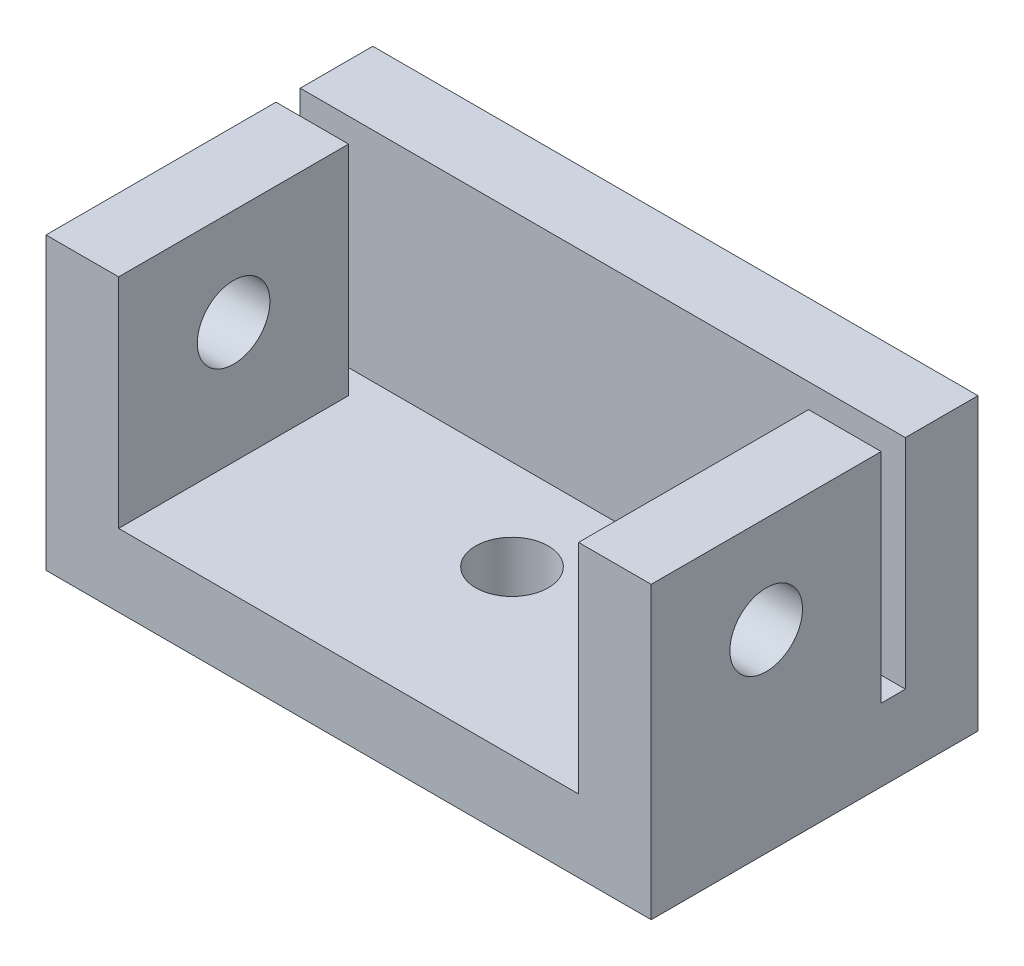
ISO-10303-21;
HEADER;
FILE_DESCRIPTION(('STEP AP214'),'2;1');
FILE_NAME('part.step','',(''),(''),'','','');
FILE_SCHEMA(('AUTOMOTIVE_DESIGN { 1 0 10303 214 1 1 1 1 }'));
ENDSEC;
DATA;
#1=APPLICATION_CONTEXT('core data for automotive mechanical design processes');
#2=APPLICATION_PROTOCOL_DEFINITION('international standard','automotive_design',2000,#1);
#3=PRODUCT_CONTEXT('',#1,'mechanical');
#4=PRODUCT('Part','Part','',(#3));
#5=PRODUCT_RELATED_PRODUCT_CATEGORY('part','',(#4));
#6=PRODUCT_DEFINITION_FORMATION('','',#4);
#7=PRODUCT_DEFINITION_CONTEXT('part definition',#1,'design');
#8=PRODUCT_DEFINITION('design','',#6,#7);
#9=PRODUCT_DEFINITION_SHAPE('','',#8);
#10=(LENGTH_UNIT() NAMED_UNIT(*) SI_UNIT(.MILLI.,.METRE.));
#11=(NAMED_UNIT(*) PLANE_ANGLE_UNIT() SI_UNIT($,.RADIAN.));
#12=(NAMED_UNIT(*) SI_UNIT($,.STERADIAN.) SOLID_ANGLE_UNIT());
#13=UNCERTAINTY_MEASURE_WITH_UNIT(LENGTH_MEASURE(1.E-05),#10,'distance_accuracy_value','');
#14=(GEOMETRIC_REPRESENTATION_CONTEXT(3) GLOBAL_UNCERTAINTY_ASSIGNED_CONTEXT((#13)) GLOBAL_UNIT_ASSIGNED_CONTEXT((#10,
#11,#12)) REPRESENTATION_CONTEXT('',''));
#15=CARTESIAN_POINT('',(0.,0.,0.));
#16=DIRECTION('',(0.,0.,1.));
#17=DIRECTION('',(1.,0.,0.));
#18=AXIS2_PLACEMENT_3D('',#15,#16,#17);
#19=CARTESIAN_POINT('',(694.894917120642,108.315701745268,-247.056360518351));
#20=DIRECTION('',(0.,0.,-1.));
#21=DIRECTION('',(-1.,0.,0.));
#22=AXIS2_PLACEMENT_3D('',#19,#20,#21);
#23=PLANE('',#22);
#24=DIRECTION('',(1.,0.,0.));
#25=VECTOR('',#24,1.);
#26=CARTESIAN_POINT('',(733.95134093076,90.3157017452683,-247.056360518351));
#27=LINE('',#26,#25);
#28=CARTESIAN_POINT('',(694.894917120642,90.3157017452683,-247.056360518351));
#29=VERTEX_POINT('',#28);
#30=CARTESIAN_POINT('',(688.894917120642,90.3157017452683,-247.056360518351));
#31=VERTEX_POINT('',#30);
#32=EDGE_CURVE('E195',#29,#31,#27,.F.);
#33=ORIENTED_EDGE('',*,*,#32,.T.);
#34=DIRECTION('',(0.,1.,0.));
#35=VECTOR('',#34,1.);
#36=CARTESIAN_POINT('',(688.894917120642,108.315701745268,-247.056360518351));
#37=LINE('',#36,#35);
#38=CARTESIAN_POINT('',(688.894917120642,108.315701745268,-247.056360518351));
#39=VERTEX_POINT('',#38);
#40=EDGE_CURVE('E128',#39,#31,#37,.F.);
#41=ORIENTED_EDGE('',*,*,#40,.F.);
#42=DIRECTION('',(1.,0.,0.));
#43=VECTOR('',#42,1.);
#44=CARTESIAN_POINT('',(556.61416335875,108.315701745268,-247.056360518351));
#45=LINE('',#44,#43);
#46=CARTESIAN_POINT('',(694.894917120642,108.315701745268,-247.056360518351));
#47=VERTEX_POINT('',#46);
#48=EDGE_CURVE('E123',#47,#39,#45,.F.);
#49=ORIENTED_EDGE('',*,*,#48,.F.);
#50=DIRECTION('',(0.,1.,0.));
#51=VECTOR('',#50,1.);
#52=CARTESIAN_POINT('',(694.894917120642,108.315701745268,-247.056360518351));
#53=LINE('',#52,#51);
#54=EDGE_CURVE('E108',#29,#47,#53,.T.);
#55=ORIENTED_EDGE('',*,*,#54,.F.);
#56=EDGE_LOOP('',(#33,#41,#49,#55));
#57=FACE_BOUND('',#56,.T.);
#58=ADVANCED_FACE('F17',(#57),#23,.T.);
#59=CARTESIAN_POINT('',(683.894893120642,100.315701745268,-237.556360518351));
#60=DIRECTION('',(1.,0.,0.));
#61=DIRECTION('',(0.,0.,-1.));
#62=AXIS2_PLACEMENT_3D('',#59,#60,#61);
#63=CYLINDRICAL_SURFACE('',#62,3.);
#64=CARTESIAN_POINT('',(694.894917120642,100.315701745268,-237.556360518351));
#65=DIRECTION('',(1.,0.,0.));
#66=DIRECTION('',(0.,0.,-1.));
#67=AXIS2_PLACEMENT_3D('',#64,#65,#66);
#68=CIRCLE('',#67,3.);
#69=CARTESIAN_POINT('',(694.894917120642,100.315701745268,-240.556360518351));
#70=VERTEX_POINT('',#69);
#71=EDGE_CURVE('E20',#70,#70,#68,.F.);
#72=ORIENTED_EDGE('',*,*,#71,.F.);
#73=EDGE_LOOP('',(#72));
#74=FACE_BOUND('',#73,.T.);
#75=CARTESIAN_POINT('',(688.894917120642,100.315701745268,-237.556360518351));
#76=DIRECTION('',(1.,0.,0.));
#77=DIRECTION('',(0.,0.,-1.));
#78=AXIS2_PLACEMENT_3D('',#75,#76,#77);
#79=CIRCLE('',#78,3.);
#80=CARTESIAN_POINT('',(688.894917120642,100.315701745268,-240.556360518351));
#81=VERTEX_POINT('',#80);
#82=EDGE_CURVE('E142',#81,#81,#79,.T.);
#83=ORIENTED_EDGE('',*,*,#82,.F.);
#84=EDGE_LOOP('',(#83));
#85=FACE_BOUND('',#84,.T.);
#86=ADVANCED_FACE('F379',(#74,#85),#63,.F.);
#87=CARTESIAN_POINT('',(694.894917120642,108.315701745268,-228.056360518351));
#88=DIRECTION('',(1.,0.,0.));
#89=DIRECTION('',(0.,0.,-1.));
#90=AXIS2_PLACEMENT_3D('',#87,#88,#89);
#91=PLANE('',#90);
#92=ORIENTED_EDGE('',*,*,#71,.T.);
#93=EDGE_LOOP('',(#92));
#94=FACE_BOUND('',#93,.T.);
#95=DIRECTION('',(0.,0.,-1.));
#96=VECTOR('',#95,1.);
#97=CARTESIAN_POINT('',(694.894917120642,90.3157017452683,-252.736733103206));
#98=LINE('',#97,#96);
#99=CARTESIAN_POINT('',(694.894917120642,90.3157017452683,-228.056360518351));
#100=VERTEX_POINT('',#99);
#101=EDGE_CURVE('E114',#100,#29,#98,.T.);
#102=ORIENTED_EDGE('',*,*,#101,.T.);
#103=ORIENTED_EDGE('',*,*,#54,.T.);
#104=DIRECTION('',(0.,0.,1.));
#105=VECTOR('',#104,1.);
#106=CARTESIAN_POINT('',(694.894917120642,108.315701745268,-58.6570709718798));
#107=LINE('',#106,#105);
#108=CARTESIAN_POINT('',(694.894917120642,108.315701745268,-228.056360518351));
#109=VERTEX_POINT('',#108);
#110=EDGE_CURVE('E112',#109,#47,#107,.F.);
#111=ORIENTED_EDGE('',*,*,#110,.F.);
#112=DIRECTION('',(0.,1.,0.));
#113=VECTOR('',#112,1.);
#114=CARTESIAN_POINT('',(694.894917120642,84.3157017452683,-228.056360518351));
#115=LINE('',#114,#113);
#116=EDGE_CURVE('E212',#100,#109,#115,.T.);
#117=ORIENTED_EDGE('',*,*,#116,.F.);
#118=EDGE_LOOP('',(#102,#103,#111,#117));
#119=FACE_BOUND('',#118,.T.);
#120=ADVANCED_FACE('F110',(#94,#119),#91,.T.);
#121=CARTESIAN_POINT('',(556.61416335875,108.315701745268,-58.6570709718798));
#122=DIRECTION('',(0.,1.,0.));
#123=DIRECTION('',(0.,0.,1.));
#124=AXIS2_PLACEMENT_3D('',#121,#122,#123);
#125=PLANE('',#124);
#126=DIRECTION('',(0.,0.,1.));
#127=VECTOR('',#126,1.);
#128=CARTESIAN_POINT('',(688.894917120642,108.315701745268,-247.056360518351));
#129=LINE('',#128,#127);
#130=CARTESIAN_POINT('',(688.894917120642,108.315701745268,-228.056360518351));
#131=VERTEX_POINT('',#130);
#132=EDGE_CURVE('E190',#131,#39,#129,.F.);
#133=ORIENTED_EDGE('',*,*,#132,.F.);
#134=DIRECTION('',(1.,0.,0.));
#135=VECTOR('',#134,1.);
#136=CARTESIAN_POINT('',(738.894917120642,108.315701745268,-228.056360518351));
#137=LINE('',#136,#135);
#138=EDGE_CURVE('E125',#109,#131,#137,.F.);
#139=ORIENTED_EDGE('',*,*,#138,.F.);
#140=ORIENTED_EDGE('',*,*,#110,.T.);
#141=ORIENTED_EDGE('',*,*,#48,.T.);
#142=EDGE_LOOP('',(#133,#139,#140,#141));
#143=FACE_BOUND('',#142,.T.);
#144=ADVANCED_FACE('F122',(#143),#125,.T.);
#145=CARTESIAN_POINT('',(732.894917120642,108.315701745268,-247.056360518351));
#146=DIRECTION('',(-1.,0.,0.));
#147=DIRECTION('',(0.,0.,1.));
#148=AXIS2_PLACEMENT_3D('',#145,#146,#147);
#149=PLANE('',#148);
#150=CARTESIAN_POINT('',(732.894917120642,100.315701745268,-237.556360518351));
#151=DIRECTION('',(1.,0.,0.));
#152=DIRECTION('',(0.,0.,-1.));
#153=AXIS2_PLACEMENT_3D('',#150,#151,#152);
#154=CIRCLE('',#153,3.);
#155=CARTESIAN_POINT('',(732.894917120642,100.315701745268,-240.556360518351));
#156=VERTEX_POINT('',#155);
#157=EDGE_CURVE('E146',#156,#156,#154,.T.);
#158=ORIENTED_EDGE('',*,*,#157,.T.);
#159=EDGE_LOOP('',(#158));
#160=FACE_BOUND('',#159,.T.);
#161=DIRECTION('',(0.,0.,-1.));
#162=VECTOR('',#161,1.);
#163=CARTESIAN_POINT('',(732.894917120642,90.3157017452683,-252.736733103206));
#164=LINE('',#163,#162);
#165=CARTESIAN_POINT('',(732.894917120642,90.3157017452683,-247.056360518351));
#166=VERTEX_POINT('',#165);
#167=CARTESIAN_POINT('',(732.894917120642,90.3157017452683,-228.056360518351));
#168=VERTEX_POINT('',#167);
#169=EDGE_CURVE('E153',#166,#168,#164,.F.);
#170=ORIENTED_EDGE('',*,*,#169,.T.);
#171=DIRECTION('',(0.,1.,0.));
#172=VECTOR('',#171,1.);
#173=CARTESIAN_POINT('',(732.894917120642,84.3157017452683,-228.056360518351));
#174=LINE('',#173,#172);
#175=CARTESIAN_POINT('',(732.894917120642,108.315701745268,-228.056360518351));
#176=VERTEX_POINT('',#175);
#177=EDGE_CURVE('E200',#176,#168,#174,.F.);
#178=ORIENTED_EDGE('',*,*,#177,.F.);
#179=DIRECTION('',(0.,0.,1.));
#180=VECTOR('',#179,1.);
#181=CARTESIAN_POINT('',(732.894917120642,108.315701745268,-58.6570709718798));
#182=LINE('',#181,#180);
#183=CARTESIAN_POINT('',(732.894917120642,108.315701745268,-247.056360518351));
#184=VERTEX_POINT('',#183);
#185=EDGE_CURVE('E102',#184,#176,#182,.T.);
#186=ORIENTED_EDGE('',*,*,#185,.F.);
#187=DIRECTION('',(0.,1.,0.));
#188=VECTOR('',#187,1.);
#189=CARTESIAN_POINT('',(732.894917120642,108.315701745268,-247.056360518351));
#190=LINE('',#189,#188);
#191=EDGE_CURVE('E149',#166,#184,#190,.T.);
#192=ORIENTED_EDGE('',*,*,#191,.F.);
#193=EDGE_LOOP('',(#170,#178,#186,#192));
#194=FACE_BOUND('',#193,.T.);
#195=ADVANCED_FACE('F199',(#160,#194),#149,.T.);
#196=CARTESIAN_POINT('',(556.61416335875,108.315701745268,-58.6570709718798));
#197=DIRECTION('',(0.,1.,0.));
#198=DIRECTION('',(0.,0.,1.));
#199=AXIS2_PLACEMENT_3D('',#196,#197,#198);
#200=PLANE('',#199);
#201=ORIENTED_EDGE('',*,*,#185,.T.);
#202=DIRECTION('',(1.,0.,0.));
#203=VECTOR('',#202,1.);
#204=CARTESIAN_POINT('',(738.894917120642,108.315701745268,-228.056360518351));
#205=LINE('',#204,#203);
#206=CARTESIAN_POINT('',(738.894917120642,108.315701745268,-228.056360518351));
#207=VERTEX_POINT('',#206);
#208=EDGE_CURVE('E208',#207,#176,#205,.F.);
#209=ORIENTED_EDGE('',*,*,#208,.F.);
#210=DIRECTION('',(0.,0.,-1.));
#211=VECTOR('',#210,1.);
#212=CARTESIAN_POINT('',(738.894917120642,108.315701745268,-228.056360518351));
#213=LINE('',#212,#211);
#214=CARTESIAN_POINT('',(738.894917120642,108.315701745268,-247.056360518351));
#215=VERTEX_POINT('',#214);
#216=EDGE_CURVE('E209',#215,#207,#213,.F.);
#217=ORIENTED_EDGE('',*,*,#216,.F.);
#218=DIRECTION('',(-1.,0.,0.));
#219=VECTOR('',#218,1.);
#220=CARTESIAN_POINT('',(738.894917120642,108.315701745268,-247.056360518351));
#221=LINE('',#220,#219);
#222=EDGE_CURVE('E155',#184,#215,#221,.F.);
#223=ORIENTED_EDGE('',*,*,#222,.F.);
#224=EDGE_LOOP('',(#201,#209,#217,#223));
#225=FACE_BOUND('',#224,.T.);
#226=ADVANCED_FACE('F349',(#225),#200,.T.);
#227=CARTESIAN_POINT('',(556.61416335875,108.315701745268,-58.6570709718798));
#228=DIRECTION('',(0.,1.,0.));
#229=DIRECTION('',(0.,0.,1.));
#230=AXIS2_PLACEMENT_3D('',#227,#228,#229);
#231=PLANE('',#230);
#232=DIRECTION('',(1.,0.,0.));
#233=VECTOR('',#232,1.);
#234=CARTESIAN_POINT('',(713.894917120642,108.315701745268,-249.056360518351));
#235=LINE('',#234,#233);
#236=CARTESIAN_POINT('',(738.894917120642,108.315701745268,-249.056360518351));
#237=VERTEX_POINT('',#236);
#238=CARTESIAN_POINT('',(688.894917120642,108.315701745268,-249.056360518351));
#239=VERTEX_POINT('',#238);
#240=EDGE_CURVE('E130',#237,#239,#235,.F.);
#241=ORIENTED_EDGE('',*,*,#240,.F.);
#242=DIRECTION('',(0.,0.,-1.));
#243=VECTOR('',#242,1.);
#244=CARTESIAN_POINT('',(738.894917120642,108.315701745268,-228.056360518351));
#245=LINE('',#244,#243);
#246=CARTESIAN_POINT('',(738.894917120642,108.315701745268,-255.056360518351));
#247=VERTEX_POINT('',#246);
#248=EDGE_CURVE('E224',#247,#237,#245,.F.);
#249=ORIENTED_EDGE('',*,*,#248,.F.);
#250=DIRECTION('',(-1.,0.,0.));
#251=VECTOR('',#250,1.);
#252=CARTESIAN_POINT('',(713.894917120642,108.315701745268,-255.056360518351));
#253=LINE('',#252,#251);
#254=CARTESIAN_POINT('',(688.894917120642,108.315701745268,-255.056360518351));
#255=VERTEX_POINT('',#254);
#256=EDGE_CURVE('E182',#255,#247,#253,.F.);
#257=ORIENTED_EDGE('',*,*,#256,.F.);
#258=DIRECTION('',(0.,0.,1.));
#259=VECTOR('',#258,1.);
#260=CARTESIAN_POINT('',(688.894917120642,108.315701745268,-247.056360518351));
#261=LINE('',#260,#259);
#262=EDGE_CURVE('E176',#239,#255,#261,.F.);
#263=ORIENTED_EDGE('',*,*,#262,.F.);
#264=EDGE_LOOP('',(#241,#249,#257,#263));
#265=FACE_BOUND('',#264,.T.);
#266=ADVANCED_FACE('F181',(#265),#231,.T.);
#267=CARTESIAN_POINT('',(713.894917120642,108.315701745268,-249.056360518351));
#268=DIRECTION('',(0.,0.,1.));
#269=DIRECTION('',(1.,0.,0.));
#270=AXIS2_PLACEMENT_3D('',#267,#268,#269);
#271=PLANE('',#270);
#272=DIRECTION('',(1.,0.,0.));
#273=VECTOR('',#272,1.);
#274=CARTESIAN_POINT('',(733.95134093076,90.3157017452683,-249.056360518351));
#275=LINE('',#274,#273);
#276=CARTESIAN_POINT('',(688.894917120642,90.3157017452683,-249.056360518351));
#277=VERTEX_POINT('',#276);
#278=CARTESIAN_POINT('',(738.894917120642,90.3157017452683,-249.056360518351));
#279=VERTEX_POINT('',#278);
#280=EDGE_CURVE('E193',#277,#279,#275,.T.);
#281=ORIENTED_EDGE('',*,*,#280,.T.);
#282=DIRECTION('',(0.,1.,0.));
#283=VECTOR('',#282,1.);
#284=CARTESIAN_POINT('',(738.894917120642,108.315701745268,-249.056360518351));
#285=LINE('',#284,#283);
#286=EDGE_CURVE('E169',#237,#279,#285,.F.);
#287=ORIENTED_EDGE('',*,*,#286,.F.);
#288=ORIENTED_EDGE('',*,*,#240,.T.);
#289=DIRECTION('',(0.,1.,0.));
#290=VECTOR('',#289,1.);
#291=CARTESIAN_POINT('',(688.894917120642,108.315701745268,-249.056360518351));
#292=LINE('',#291,#290);
#293=EDGE_CURVE('E168',#277,#239,#292,.T.);
#294=ORIENTED_EDGE('',*,*,#293,.F.);
#295=EDGE_LOOP('',(#281,#287,#288,#294));
#296=FACE_BOUND('',#295,.T.);
#297=ADVANCED_FACE('F167',(#296),#271,.T.);
#298=CARTESIAN_POINT('',(738.894917120642,108.315701745268,-247.056360518351));
#299=DIRECTION('',(0.,0.,-1.));
#300=DIRECTION('',(-1.,0.,0.));
#301=AXIS2_PLACEMENT_3D('',#298,#299,#300);
#302=PLANE('',#301);
#303=DIRECTION('',(1.,0.,0.));
#304=VECTOR('',#303,1.);
#305=CARTESIAN_POINT('',(733.95134093076,90.3157017452683,-247.056360518351));
#306=LINE('',#305,#304);
#307=CARTESIAN_POINT('',(738.894917120642,90.3157017452683,-247.056360518351));
#308=VERTEX_POINT('',#307);
#309=EDGE_CURVE('E148',#308,#166,#306,.F.);
#310=ORIENTED_EDGE('',*,*,#309,.T.);
#311=ORIENTED_EDGE('',*,*,#191,.T.);
#312=ORIENTED_EDGE('',*,*,#222,.T.);
#313=DIRECTION('',(0.,1.,0.));
#314=VECTOR('',#313,1.);
#315=CARTESIAN_POINT('',(738.894917120642,108.315701745268,-247.056360518351));
#316=LINE('',#315,#314);
#317=EDGE_CURVE('E141',#308,#215,#316,.T.);
#318=ORIENTED_EDGE('',*,*,#317,.F.);
#319=EDGE_LOOP('',(#310,#311,#312,#318));
#320=FACE_BOUND('',#319,.T.);
#321=ADVANCED_FACE('F326',(#320),#302,.T.);
#322=CARTESIAN_POINT('',(683.894893120642,100.315701745268,-237.556360518351));
#323=DIRECTION('',(1.,0.,0.));
#324=DIRECTION('',(0.,0.,-1.));
#325=AXIS2_PLACEMENT_3D('',#322,#323,#324);
#326=CYLINDRICAL_SURFACE('',#325,3.);
#327=CARTESIAN_POINT('',(738.894917120642,100.315701745268,-237.556360518351));
#328=DIRECTION('',(1.,0.,0.));
#329=DIRECTION('',(0.,0.,-1.));
#330=AXIS2_PLACEMENT_3D('',#327,#328,#329);
#331=CIRCLE('',#330,3.);
#332=CARTESIAN_POINT('',(738.894917120642,100.315701745268,-240.556360518351));
#333=VERTEX_POINT('',#332);
#334=EDGE_CURVE('E138',#333,#333,#331,.F.);
#335=ORIENTED_EDGE('',*,*,#334,.F.);
#336=EDGE_LOOP('',(#335));
#337=FACE_BOUND('',#336,.T.);
#338=ORIENTED_EDGE('',*,*,#157,.F.);
#339=EDGE_LOOP('',(#338));
#340=FACE_BOUND('',#339,.T.);
#341=ADVANCED_FACE('F258',(#337,#340),#326,.F.);
#342=CARTESIAN_POINT('',(733.95134093076,90.3157017452683,-252.736733103206));
#343=DIRECTION('',(0.,-1.,0.));
#344=DIRECTION('',(0.,0.,-1.));
#345=AXIS2_PLACEMENT_3D('',#342,#343,#344);
#346=PLANE('',#345);
#347=CARTESIAN_POINT('',(713.894917120642,90.3157017452683,-241.556360518351));
#348=DIRECTION('',(0.,-1.,0.));
#349=DIRECTION('',(0.,0.,-1.));
#350=AXIS2_PLACEMENT_3D('',#347,#348,#349);
#351=CIRCLE('',#350,3.);
#352=CARTESIAN_POINT('',(713.894917120642,90.3157017452683,-244.556360518351));
#353=VERTEX_POINT('',#352);
#354=EDGE_CURVE('E134',#353,#353,#351,.T.);
#355=ORIENTED_EDGE('',*,*,#354,.T.);
#356=EDGE_LOOP('',(#355));
#357=FACE_BOUND('',#356,.T.);
#358=DIRECTION('',(0.,0.,1.));
#359=VECTOR('',#358,1.);
#360=CARTESIAN_POINT('',(688.894917120642,90.3157017452683,-247.056360518351));
#361=LINE('',#360,#359);
#362=EDGE_CURVE('E179',#31,#277,#361,.F.);
#363=ORIENTED_EDGE('',*,*,#362,.F.);
#364=ORIENTED_EDGE('',*,*,#32,.F.);
#365=ORIENTED_EDGE('',*,*,#101,.F.);
#366=DIRECTION('',(1.,0.,0.));
#367=VECTOR('',#366,1.);
#368=CARTESIAN_POINT('',(738.894917120642,90.3157017452683,-228.056360518351));
#369=LINE('',#368,#367);
#370=EDGE_CURVE('E144',#168,#100,#369,.F.);
#371=ORIENTED_EDGE('',*,*,#370,.F.);
#372=ORIENTED_EDGE('',*,*,#169,.F.);
#373=ORIENTED_EDGE('',*,*,#309,.F.);
#374=DIRECTION('',(0.,0.,-1.));
#375=VECTOR('',#374,1.);
#376=CARTESIAN_POINT('',(738.894917120642,90.3157017452683,-228.056360518351));
#377=LINE('',#376,#375);
#378=EDGE_CURVE('E227',#279,#308,#377,.F.);
#379=ORIENTED_EDGE('',*,*,#378,.F.);
#380=ORIENTED_EDGE('',*,*,#280,.F.);
#381=EDGE_LOOP('',(#363,#364,#365,#371,#372,#373,#379,#380));
#382=FACE_BOUND('',#381,.T.);
#383=ADVANCED_FACE('F211',(#357,#382),#346,.F.);
#384=CARTESIAN_POINT('',(713.894917120642,108.315701745268,-255.056360518351));
#385=DIRECTION('',(0.,0.,-1.));
#386=DIRECTION('',(-1.,0.,0.));
#387=AXIS2_PLACEMENT_3D('',#384,#385,#386);
#388=PLANE('',#387);
#389=DIRECTION('',(1.,0.,0.));
#390=VECTOR('',#389,1.);
#391=CARTESIAN_POINT('',(556.61416335875,84.3157017452683,-255.056360518351));
#392=LINE('',#391,#390);
#393=CARTESIAN_POINT('',(738.894917120642,84.3157017452683,-255.056360518351));
#394=VERTEX_POINT('',#393);
#395=CARTESIAN_POINT('',(688.894917120642,84.3157017452683,-255.056360518351));
#396=VERTEX_POINT('',#395);
#397=EDGE_CURVE('E137',#394,#396,#392,.F.);
#398=ORIENTED_EDGE('',*,*,#397,.T.);
#399=DIRECTION('',(0.,1.,0.));
#400=VECTOR('',#399,1.);
#401=CARTESIAN_POINT('',(688.894917120642,108.315701745268,-255.056360518351));
#402=LINE('',#401,#400);
#403=EDGE_CURVE('E145',#255,#396,#402,.F.);
#404=ORIENTED_EDGE('',*,*,#403,.F.);
#405=ORIENTED_EDGE('',*,*,#256,.T.);
#406=DIRECTION('',(0.,1.,0.));
#407=VECTOR('',#406,1.);
#408=CARTESIAN_POINT('',(738.894917120642,108.315701745268,-255.056360518351));
#409=LINE('',#408,#407);
#410=EDGE_CURVE('E221',#394,#247,#409,.T.);
#411=ORIENTED_EDGE('',*,*,#410,.F.);
#412=EDGE_LOOP('',(#398,#404,#405,#411));
#413=FACE_BOUND('',#412,.T.);
#414=ADVANCED_FACE('F248',(#413),#388,.T.);
#415=CARTESIAN_POINT('',(688.894917120642,108.315701745268,-247.056360518351));
#416=DIRECTION('',(-1.,0.,0.));
#417=DIRECTION('',(0.,0.,1.));
#418=AXIS2_PLACEMENT_3D('',#415,#416,#417);
#419=PLANE('',#418);
#420=ORIENTED_EDGE('',*,*,#82,.T.);
#421=EDGE_LOOP('',(#420));
#422=FACE_BOUND('',#421,.T.);
#423=ORIENTED_EDGE('',*,*,#262,.T.);
#424=ORIENTED_EDGE('',*,*,#403,.T.);
#425=DIRECTION('',(0.,0.,1.));
#426=VECTOR('',#425,1.);
#427=CARTESIAN_POINT('',(688.894917120642,84.3157017452683,-58.6570709718798));
#428=LINE('',#427,#426);
#429=CARTESIAN_POINT('',(688.894917120642,84.3157017452683,-228.056360518351));
#430=VERTEX_POINT('',#429);
#431=EDGE_CURVE('E234',#396,#430,#428,.T.);
#432=ORIENTED_EDGE('',*,*,#431,.T.);
#433=DIRECTION('',(0.,1.,0.));
#434=VECTOR('',#433,1.);
#435=CARTESIAN_POINT('',(688.894917120642,84.3157017452683,-228.056360518351));
#436=LINE('',#435,#434);
#437=EDGE_CURVE('E216',#131,#430,#436,.F.);
#438=ORIENTED_EDGE('',*,*,#437,.F.);
#439=ORIENTED_EDGE('',*,*,#132,.T.);
#440=ORIENTED_EDGE('',*,*,#40,.T.);
#441=ORIENTED_EDGE('',*,*,#362,.T.);
#442=ORIENTED_EDGE('',*,*,#293,.T.);
#443=EDGE_LOOP('',(#423,#424,#432,#438,#439,#440,#441,#442));
#444=FACE_BOUND('',#443,.T.);
#445=ADVANCED_FACE('F175',(#422,#444),#419,.T.);
#446=CARTESIAN_POINT('',(738.894917120642,84.3157017452683,-228.056360518351));
#447=DIRECTION('',(0.,0.,1.));
#448=DIRECTION('',(1.,0.,0.));
#449=AXIS2_PLACEMENT_3D('',#446,#447,#448);
#450=PLANE('',#449);
#451=ORIENTED_EDGE('',*,*,#208,.T.);
#452=ORIENTED_EDGE('',*,*,#177,.T.);
#453=ORIENTED_EDGE('',*,*,#370,.T.);
#454=ORIENTED_EDGE('',*,*,#116,.T.);
#455=ORIENTED_EDGE('',*,*,#138,.T.);
#456=ORIENTED_EDGE('',*,*,#437,.T.);
#457=DIRECTION('',(1.,0.,0.));
#458=VECTOR('',#457,1.);
#459=CARTESIAN_POINT('',(556.61416335875,84.3157017452683,-228.056360518351));
#460=LINE('',#459,#458);
#461=CARTESIAN_POINT('',(738.894917120642,84.3157017452683,-228.056360518351));
#462=VERTEX_POINT('',#461);
#463=EDGE_CURVE('E237',#430,#462,#460,.T.);
#464=ORIENTED_EDGE('',*,*,#463,.T.);
#465=DIRECTION('',(0.,1.,0.));
#466=VECTOR('',#465,1.);
#467=CARTESIAN_POINT('',(738.894917120642,108.315701745268,-228.056360518351));
#468=LINE('',#467,#466);
#469=EDGE_CURVE('E35',#207,#462,#468,.F.);
#470=ORIENTED_EDGE('',*,*,#469,.F.);
#471=EDGE_LOOP('',(#451,#452,#453,#454,#455,#456,#464,#470));
#472=FACE_BOUND('',#471,.T.);
#473=ADVANCED_FACE('F206',(#472),#450,.T.);
#474=CARTESIAN_POINT('',(738.894917120642,108.315701745268,-228.056360518351));
#475=DIRECTION('',(1.,0.,0.));
#476=DIRECTION('',(0.,0.,-1.));
#477=AXIS2_PLACEMENT_3D('',#474,#475,#476);
#478=PLANE('',#477);
#479=ORIENTED_EDGE('',*,*,#334,.T.);
#480=EDGE_LOOP('',(#479));
#481=FACE_BOUND('',#480,.T.);
#482=ORIENTED_EDGE('',*,*,#378,.T.);
#483=ORIENTED_EDGE('',*,*,#317,.T.);
#484=ORIENTED_EDGE('',*,*,#216,.T.);
#485=ORIENTED_EDGE('',*,*,#469,.T.);
#486=DIRECTION('',(0.,0.,1.));
#487=VECTOR('',#486,1.);
#488=CARTESIAN_POINT('',(738.894917120642,84.3157017452683,-58.6570709718798));
#489=LINE('',#488,#487);
#490=EDGE_CURVE('E26',#462,#394,#489,.F.);
#491=ORIENTED_EDGE('',*,*,#490,.T.);
#492=ORIENTED_EDGE('',*,*,#410,.T.);
#493=ORIENTED_EDGE('',*,*,#248,.T.);
#494=ORIENTED_EDGE('',*,*,#286,.T.);
#495=EDGE_LOOP('',(#482,#483,#484,#485,#491,#492,#493,#494));
#496=FACE_BOUND('',#495,.T.);
#497=ADVANCED_FACE('F240',(#481,#496),#478,.T.);
#498=CARTESIAN_POINT('',(713.894917120642,84.3157017452683,-241.556360518351));
#499=DIRECTION('',(0.,-1.,0.));
#500=DIRECTION('',(0.,0.,-1.));
#501=AXIS2_PLACEMENT_3D('',#498,#499,#500);
#502=CYLINDRICAL_SURFACE('',#501,3.);
#503=ORIENTED_EDGE('',*,*,#354,.F.);
#504=EDGE_LOOP('',(#503));
#505=FACE_BOUND('',#504,.T.);
#506=CARTESIAN_POINT('',(713.894917120642,84.3157017452683,-241.556360518351));
#507=DIRECTION('',(0.,-1.,0.));
#508=DIRECTION('',(0.,0.,-1.));
#509=AXIS2_PLACEMENT_3D('',#506,#507,#508);
#510=CIRCLE('',#509,3.);
#511=CARTESIAN_POINT('',(713.894917120642,84.3157017452683,-244.556360518351));
#512=VERTEX_POINT('',#511);
#513=EDGE_CURVE('E11',#512,#512,#510,.T.);
#514=ORIENTED_EDGE('',*,*,#513,.T.);
#515=EDGE_LOOP('',(#514));
#516=FACE_BOUND('',#515,.T.);
#517=ADVANCED_FACE('F262',(#505,#516),#502,.F.);
#518=CARTESIAN_POINT('',(556.61416335875,84.3157017452683,-58.6570709718798));
#519=DIRECTION('',(0.,1.,0.));
#520=DIRECTION('',(0.,0.,1.));
#521=AXIS2_PLACEMENT_3D('',#518,#519,#520);
#522=PLANE('',#521);
#523=ORIENTED_EDGE('',*,*,#513,.F.);
#524=EDGE_LOOP('',(#523));
#525=FACE_BOUND('',#524,.T.);
#526=ORIENTED_EDGE('',*,*,#463,.F.);
#527=ORIENTED_EDGE('',*,*,#431,.F.);
#528=ORIENTED_EDGE('',*,*,#397,.F.);
#529=ORIENTED_EDGE('',*,*,#490,.F.);
#530=EDGE_LOOP('',(#526,#527,#528,#529));
#531=FACE_BOUND('',#530,.T.);
#532=ADVANCED_FACE('F244',(#525,#531),#522,.F.);
#533=CLOSED_SHELL('',(#58,#86,#120,#144,#195,#226,#266,#297,#321,#341,#383,#414,#445,#473,#497,
#517,#532));
#534=MANIFOLD_SOLID_BREP('B1',#533);
#535=ADVANCED_BREP_SHAPE_REPRESENTATION('',(#18,#534),#14);
#536=SHAPE_DEFINITION_REPRESENTATION(#9,#535);
ENDSEC;
END-ISO-10303-21;
